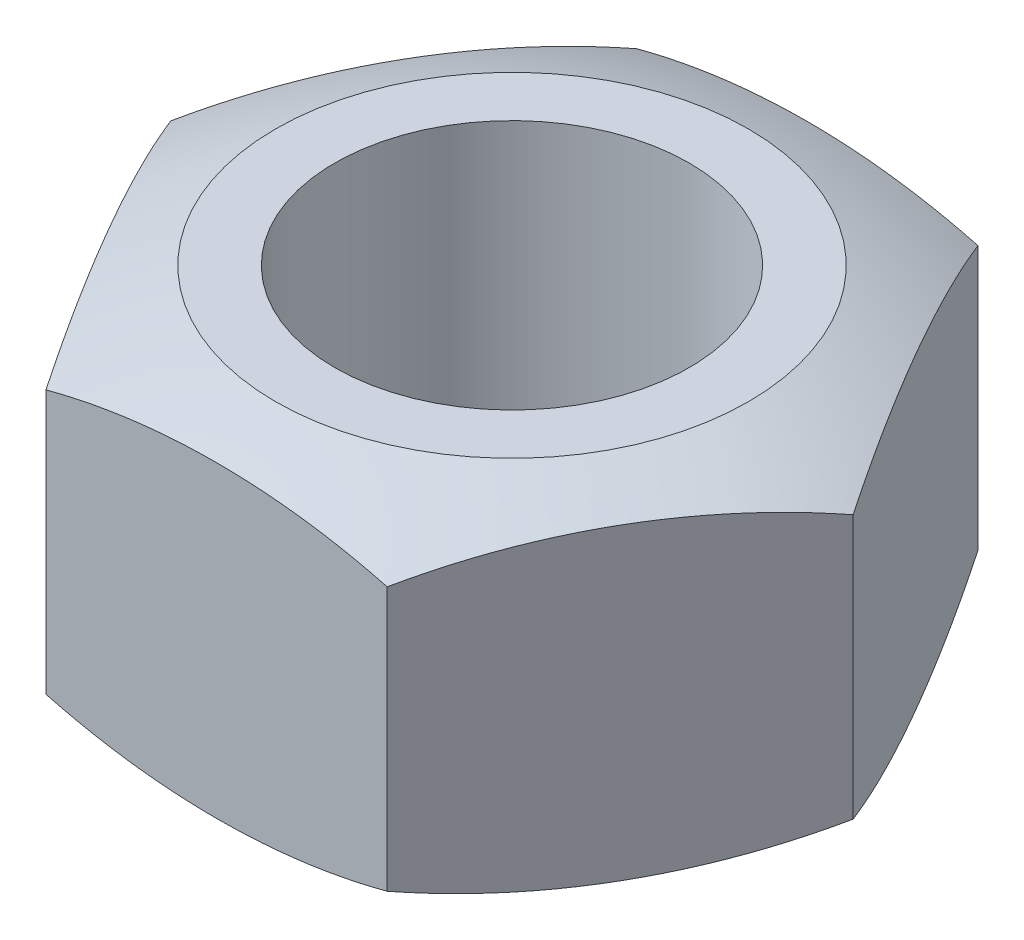
ISO-10303-21;
HEADER;
FILE_DESCRIPTION(('STEP AP214'),'2;1');
FILE_NAME('part.step','',(''),(''),'','','');
FILE_SCHEMA(('AUTOMOTIVE_DESIGN { 1 0 10303 214 1 1 1 1 }'));
ENDSEC;
DATA;
#1=APPLICATION_CONTEXT('core data for automotive mechanical design processes');
#2=APPLICATION_PROTOCOL_DEFINITION('international standard','automotive_design',2000,#1);
#3=PRODUCT_CONTEXT('',#1,'mechanical');
#4=PRODUCT('Part','Part','',(#3));
#5=PRODUCT_RELATED_PRODUCT_CATEGORY('part','',(#4));
#6=PRODUCT_DEFINITION_FORMATION('','',#4);
#7=PRODUCT_DEFINITION_CONTEXT('part definition',#1,'design');
#8=PRODUCT_DEFINITION('design','',#6,#7);
#9=PRODUCT_DEFINITION_SHAPE('','',#8);
#10=(LENGTH_UNIT() NAMED_UNIT(*) SI_UNIT(.MILLI.,.METRE.));
#11=(NAMED_UNIT(*) PLANE_ANGLE_UNIT() SI_UNIT($,.RADIAN.));
#12=(NAMED_UNIT(*) SI_UNIT($,.STERADIAN.) SOLID_ANGLE_UNIT());
#13=UNCERTAINTY_MEASURE_WITH_UNIT(LENGTH_MEASURE(1.E-05),#10,'distance_accuracy_value','');
#14=(GEOMETRIC_REPRESENTATION_CONTEXT(3) GLOBAL_UNCERTAINTY_ASSIGNED_CONTEXT((#13)) GLOBAL_UNIT_ASSIGNED_CONTEXT((#10,
#11,#12)) REPRESENTATION_CONTEXT('',''));
#15=CARTESIAN_POINT('',(0.,0.,0.));
#16=DIRECTION('',(0.,0.,1.));
#17=DIRECTION('',(1.,0.,0.));
#18=AXIS2_PLACEMENT_3D('',#15,#16,#17);
#19=CARTESIAN_POINT('',(2.88675134594813,6.,5.));
#20=DIRECTION('',(0.,-1.,0.));
#21=DIRECTION('',(0.,0.,-1.));
#22=AXIS2_PLACEMENT_3D('',#19,#20,#21);
#23=PLANE('',#22);
#24=CARTESIAN_POINT('',(0.,6.,0.));
#25=DIRECTION('',(0.,-1.,0.));
#26=DIRECTION('',(0.,0.,-1.));
#27=AXIS2_PLACEMENT_3D('',#24,#25,#26);
#28=CIRCLE('',#27,4.);
#29=CARTESIAN_POINT('',(0.,6.,-4.));
#30=VERTEX_POINT('',#29);
#31=EDGE_CURVE('E36',#30,#30,#28,.F.);
#32=ORIENTED_EDGE('',*,*,#31,.T.);
#33=EDGE_LOOP('',(#32));
#34=FACE_BOUND('',#33,.T.);
#35=CARTESIAN_POINT('',(0.,6.,0.));
#36=DIRECTION('',(0.,1.,0.));
#37=DIRECTION('',(0.,0.,1.));
#38=AXIS2_PLACEMENT_3D('',#35,#36,#37);
#39=CIRCLE('',#38,3.);
#40=CARTESIAN_POINT('',(0.,6.,3.));
#41=VERTEX_POINT('',#40);
#42=EDGE_CURVE('E138',#41,#41,#39,.T.);
#43=ORIENTED_EDGE('',*,*,#42,.F.);
#44=EDGE_LOOP('',(#43));
#45=FACE_BOUND('',#44,.T.);
#46=ADVANCED_FACE('F32',(#34,#45),#23,.F.);
#47=CARTESIAN_POINT('',(2.88675134594813,0.,5.));
#48=DIRECTION('',(0.,-1.,0.));
#49=DIRECTION('',(0.,0.,-1.));
#50=AXIS2_PLACEMENT_3D('',#47,#48,#49);
#51=PLANE('',#50);
#52=CARTESIAN_POINT('',(0.,0.,0.));
#53=DIRECTION('',(0.,-1.,0.));
#54=DIRECTION('',(0.,0.,-1.));
#55=AXIS2_PLACEMENT_3D('',#52,#53,#54);
#56=CIRCLE('',#55,4.);
#57=CARTESIAN_POINT('',(0.,0.,-4.));
#58=VERTEX_POINT('',#57);
#59=EDGE_CURVE('E110',#58,#58,#56,.F.);
#60=ORIENTED_EDGE('',*,*,#59,.F.);
#61=EDGE_LOOP('',(#60));
#62=FACE_BOUND('',#61,.T.);
#63=CARTESIAN_POINT('',(0.,0.,0.));
#64=DIRECTION('',(0.,1.,0.));
#65=DIRECTION('',(0.,0.,1.));
#66=AXIS2_PLACEMENT_3D('',#63,#64,#65);
#67=CIRCLE('',#66,3.);
#68=CARTESIAN_POINT('',(0.,0.,3.));
#69=VERTEX_POINT('',#68);
#70=EDGE_CURVE('E141',#69,#69,#67,.T.);
#71=ORIENTED_EDGE('',*,*,#70,.T.);
#72=EDGE_LOOP('',(#71));
#73=FACE_BOUND('',#72,.T.);
#74=ADVANCED_FACE('F168',(#62,#73),#51,.T.);
#75=CARTESIAN_POINT('',(0.,0.,0.));
#76=DIRECTION('',(0.,1.,0.));
#77=DIRECTION('',(0.,0.,1.));
#78=AXIS2_PLACEMENT_3D('',#75,#76,#77);
#79=CYLINDRICAL_SURFACE('',#78,3.);
#80=ORIENTED_EDGE('',*,*,#70,.F.);
#81=EDGE_LOOP('',(#80));
#82=FACE_BOUND('',#81,.T.);
#83=ORIENTED_EDGE('',*,*,#42,.T.);
#84=EDGE_LOOP('',(#83));
#85=FACE_BOUND('',#84,.T.);
#86=ADVANCED_FACE('F173',(#82,#85),#79,.F.);
#87=CARTESIAN_POINT('',(0.,11.6575133769294,0.));
#88=DIRECTION('',(0.,-1.,0.));
#89=DIRECTION('',(1.,0.,0.));
#90=AXIS2_PLACEMENT_3D('',#87,#88,#89);
#91=SPHERICAL_SURFACE('',#90,12.3246751735406);
#92=ORIENTED_EDGE('',*,*,#59,.T.);
#93=EDGE_LOOP('',(#92));
#94=FACE_BOUND('',#93,.T.);
#95=CARTESIAN_POINT('',(0.,11.6575133769294,5.));
#96=DIRECTION('',(0.,0.,-1.));
#97=DIRECTION('',(-1.,0.,0.));
#98=AXIS2_PLACEMENT_3D('',#95,#96,#97);
#99=CIRCLE('',#98,11.2648842929383);
#100=CARTESIAN_POINT('',(-2.88675134594813,0.768790550079844,5.));
#101=VERTEX_POINT('',#100);
#102=CARTESIAN_POINT('',(2.88675134594813,0.768790550079843,5.));
#103=VERTEX_POINT('',#102);
#104=EDGE_CURVE('E112',#101,#103,#99,.F.);
#105=ORIENTED_EDGE('',*,*,#104,.F.);
#106=CARTESIAN_POINT('',(-4.33012701892219,11.6575133769294,2.5));
#107=DIRECTION('',(0.866025403784439,0.,-0.5));
#108=DIRECTION('',(-0.5,0.,-0.866025403784439));
#109=AXIS2_PLACEMENT_3D('',#106,#107,#108);
#110=CIRCLE('',#109,11.2648842929383);
#111=CARTESIAN_POINT('',(-5.77350269189626,0.768790550079844,0.));
#112=VERTEX_POINT('',#111);
#113=EDGE_CURVE('E115',#112,#101,#110,.F.);
#114=ORIENTED_EDGE('',*,*,#113,.F.);
#115=CARTESIAN_POINT('',(-4.33012701892219,11.6575133769294,-2.5));
#116=DIRECTION('',(0.866025403784439,0.,0.5));
#117=DIRECTION('',(0.5,0.,-0.866025403784439));
#118=AXIS2_PLACEMENT_3D('',#115,#116,#117);
#119=CIRCLE('',#118,11.2648842929383);
#120=CARTESIAN_POINT('',(-2.88675134594813,0.768790550079844,-5.));
#121=VERTEX_POINT('',#120);
#122=EDGE_CURVE('E90',#121,#112,#119,.F.);
#123=ORIENTED_EDGE('',*,*,#122,.F.);
#124=CARTESIAN_POINT('',(0.,11.6575133769294,-5.));
#125=DIRECTION('',(0.,0.,1.));
#126=DIRECTION('',(1.,0.,0.));
#127=AXIS2_PLACEMENT_3D('',#124,#125,#126);
#128=CIRCLE('',#127,11.2648842929383);
#129=CARTESIAN_POINT('',(2.88675134594813,0.768790550079844,-5.));
#130=VERTEX_POINT('',#129);
#131=EDGE_CURVE('E85',#130,#121,#128,.F.);
#132=ORIENTED_EDGE('',*,*,#131,.F.);
#133=CARTESIAN_POINT('',(4.33012701892219,11.6575133769294,-2.5));
#134=DIRECTION('',(-0.866025403784438,0.,0.5));
#135=DIRECTION('',(0.5,0.,0.866025403784438));
#136=AXIS2_PLACEMENT_3D('',#133,#134,#135);
#137=CIRCLE('',#136,11.2648842929383);
#138=CARTESIAN_POINT('',(5.77350269189626,0.768790550079844,0.));
#139=VERTEX_POINT('',#138);
#140=EDGE_CURVE('E88',#139,#130,#137,.F.);
#141=ORIENTED_EDGE('',*,*,#140,.F.);
#142=CARTESIAN_POINT('',(4.3301270189222,11.6575133769294,2.5));
#143=DIRECTION('',(-0.866025403784439,0.,-0.5));
#144=DIRECTION('',(-0.5,0.,0.866025403784439));
#145=AXIS2_PLACEMENT_3D('',#142,#143,#144);
#146=CIRCLE('',#145,11.2648842929383);
#147=EDGE_CURVE('E57',#103,#139,#146,.F.);
#148=ORIENTED_EDGE('',*,*,#147,.F.);
#149=EDGE_LOOP('',(#105,#114,#123,#132,#141,#148));
#150=FACE_BOUND('',#149,.T.);
#151=ADVANCED_FACE('F87',(#94,#150),#91,.T.);
#152=CARTESIAN_POINT('',(0.,-5.6575133769294,0.));
#153=DIRECTION('',(0.,-1.,0.));
#154=DIRECTION('',(1.,0.,0.));
#155=AXIS2_PLACEMENT_3D('',#152,#153,#154);
#156=SPHERICAL_SURFACE('',#155,12.3246751735406);
#157=ORIENTED_EDGE('',*,*,#31,.F.);
#158=EDGE_LOOP('',(#157));
#159=FACE_BOUND('',#158,.T.);
#160=CARTESIAN_POINT('',(4.33012701892219,-5.6575133769294,-2.5));
#161=DIRECTION('',(-0.866025403784438,0.,0.5));
#162=DIRECTION('',(0.5,0.,0.866025403784438));
#163=AXIS2_PLACEMENT_3D('',#160,#161,#162);
#164=CIRCLE('',#163,11.2648842929383);
#165=CARTESIAN_POINT('',(2.88675134594812,5.23120944992016,-5.));
#166=VERTEX_POINT('',#165);
#167=CARTESIAN_POINT('',(5.77350269189626,5.23120944992016,0.));
#168=VERTEX_POINT('',#167);
#169=EDGE_CURVE('E133',#166,#168,#164,.F.);
#170=ORIENTED_EDGE('',*,*,#169,.F.);
#171=CARTESIAN_POINT('',(0.,-5.6575133769294,-5.));
#172=DIRECTION('',(0.,0.,1.));
#173=DIRECTION('',(1.,0.,0.));
#174=AXIS2_PLACEMENT_3D('',#171,#172,#173);
#175=CIRCLE('',#174,11.2648842929383);
#176=CARTESIAN_POINT('',(-2.88675134594813,5.23120944992016,-5.));
#177=VERTEX_POINT('',#176);
#178=EDGE_CURVE('E104',#177,#166,#175,.F.);
#179=ORIENTED_EDGE('',*,*,#178,.F.);
#180=CARTESIAN_POINT('',(-4.33012701892219,-5.6575133769294,-2.5));
#181=DIRECTION('',(0.866025403784439,0.,0.5));
#182=DIRECTION('',(0.5,0.,-0.866025403784439));
#183=AXIS2_PLACEMENT_3D('',#180,#181,#182);
#184=CIRCLE('',#183,11.2648842929383);
#185=CARTESIAN_POINT('',(-5.77350269189626,5.23120944992016,0.));
#186=VERTEX_POINT('',#185);
#187=EDGE_CURVE('E129',#186,#177,#184,.F.);
#188=ORIENTED_EDGE('',*,*,#187,.F.);
#189=CARTESIAN_POINT('',(-4.33012701892219,-5.6575133769294,2.5));
#190=DIRECTION('',(0.866025403784439,0.,-0.5));
#191=DIRECTION('',(-0.5,0.,-0.866025403784439));
#192=AXIS2_PLACEMENT_3D('',#189,#190,#191);
#193=CIRCLE('',#192,11.2648842929383);
#194=CARTESIAN_POINT('',(-2.88675134594813,5.23120944992016,5.));
#195=VERTEX_POINT('',#194);
#196=EDGE_CURVE('E49',#195,#186,#193,.F.);
#197=ORIENTED_EDGE('',*,*,#196,.F.);
#198=CARTESIAN_POINT('',(0.,-5.6575133769294,5.));
#199=DIRECTION('',(0.,0.,-1.));
#200=DIRECTION('',(-1.,0.,0.));
#201=AXIS2_PLACEMENT_3D('',#198,#199,#200);
#202=CIRCLE('',#201,11.2648842929383);
#203=CARTESIAN_POINT('',(2.88675134594813,5.23120944992016,5.));
#204=VERTEX_POINT('',#203);
#205=EDGE_CURVE('E126',#204,#195,#202,.F.);
#206=ORIENTED_EDGE('',*,*,#205,.F.);
#207=CARTESIAN_POINT('',(4.3301270189222,-5.6575133769294,2.5));
#208=DIRECTION('',(-0.866025403784439,0.,-0.5));
#209=DIRECTION('',(-0.5,0.,0.866025403784439));
#210=AXIS2_PLACEMENT_3D('',#207,#208,#209);
#211=CIRCLE('',#210,11.2648842929383);
#212=EDGE_CURVE('E135',#168,#204,#211,.F.);
#213=ORIENTED_EDGE('',*,*,#212,.F.);
#214=EDGE_LOOP('',(#170,#179,#188,#197,#206,#213));
#215=FACE_BOUND('',#214,.T.);
#216=ADVANCED_FACE('F154',(#159,#215),#156,.T.);
#217=CARTESIAN_POINT('',(-2.88675134594813,6.,5.));
#218=DIRECTION('',(0.,0.,-1.));
#219=DIRECTION('',(-1.,0.,0.));
#220=AXIS2_PLACEMENT_3D('',#217,#218,#219);
#221=PLANE('',#220);
#222=DIRECTION('',(0.,-1.,0.));
#223=VECTOR('',#222,1.);
#224=CARTESIAN_POINT('',(2.88675134594813,6.,5.));
#225=LINE('',#224,#223);
#226=EDGE_CURVE('E144',#204,#103,#225,.T.);
#227=ORIENTED_EDGE('',*,*,#226,.F.);
#228=ORIENTED_EDGE('',*,*,#205,.T.);
#229=DIRECTION('',(0.,-1.,0.));
#230=VECTOR('',#229,1.);
#231=CARTESIAN_POINT('',(-2.88675134594813,6.,5.));
#232=LINE('',#231,#230);
#233=EDGE_CURVE('E146',#195,#101,#232,.T.);
#234=ORIENTED_EDGE('',*,*,#233,.T.);
#235=ORIENTED_EDGE('',*,*,#104,.T.);
#236=EDGE_LOOP('',(#227,#228,#234,#235));
#237=FACE_BOUND('',#236,.T.);
#238=ADVANCED_FACE('F156',(#237),#221,.F.);
#239=CARTESIAN_POINT('',(-5.77350269189626,6.,0.));
#240=DIRECTION('',(0.866025403784439,0.,-0.5));
#241=DIRECTION('',(-0.5,0.,-0.866025403784439));
#242=AXIS2_PLACEMENT_3D('',#239,#240,#241);
#243=PLANE('',#242);
#244=ORIENTED_EDGE('',*,*,#233,.F.);
#245=ORIENTED_EDGE('',*,*,#196,.T.);
#246=DIRECTION('',(0.,-1.,0.));
#247=VECTOR('',#246,1.);
#248=CARTESIAN_POINT('',(-5.77350269189626,6.,0.));
#249=LINE('',#248,#247);
#250=EDGE_CURVE('E107',#186,#112,#249,.T.);
#251=ORIENTED_EDGE('',*,*,#250,.T.);
#252=ORIENTED_EDGE('',*,*,#113,.T.);
#253=EDGE_LOOP('',(#244,#245,#251,#252));
#254=FACE_BOUND('',#253,.T.);
#255=ADVANCED_FACE('F151',(#254),#243,.F.);
#256=CARTESIAN_POINT('',(-2.88675134594813,6.,-5.));
#257=DIRECTION('',(0.866025403784439,0.,0.5));
#258=DIRECTION('',(0.5,0.,-0.866025403784439));
#259=AXIS2_PLACEMENT_3D('',#256,#257,#258);
#260=PLANE('',#259);
#261=ORIENTED_EDGE('',*,*,#250,.F.);
#262=ORIENTED_EDGE('',*,*,#187,.T.);
#263=DIRECTION('',(0.,-1.,0.));
#264=VECTOR('',#263,1.);
#265=CARTESIAN_POINT('',(-2.88675134594813,6.,-5.));
#266=LINE('',#265,#264);
#267=EDGE_CURVE('E105',#177,#121,#266,.T.);
#268=ORIENTED_EDGE('',*,*,#267,.T.);
#269=ORIENTED_EDGE('',*,*,#122,.T.);
#270=EDGE_LOOP('',(#261,#262,#268,#269));
#271=FACE_BOUND('',#270,.T.);
#272=ADVANCED_FACE('F153',(#271),#260,.F.);
#273=CARTESIAN_POINT('',(2.88675134594813,6.,-5.));
#274=DIRECTION('',(0.,0.,1.));
#275=DIRECTION('',(1.,0.,0.));
#276=AXIS2_PLACEMENT_3D('',#273,#274,#275);
#277=PLANE('',#276);
#278=ORIENTED_EDGE('',*,*,#267,.F.);
#279=ORIENTED_EDGE('',*,*,#178,.T.);
#280=DIRECTION('',(0.,-1.,0.));
#281=VECTOR('',#280,1.);
#282=CARTESIAN_POINT('',(2.88675134594813,6.,-5.));
#283=LINE('',#282,#281);
#284=EDGE_CURVE('E41',#166,#130,#283,.T.);
#285=ORIENTED_EDGE('',*,*,#284,.T.);
#286=ORIENTED_EDGE('',*,*,#131,.T.);
#287=EDGE_LOOP('',(#278,#279,#285,#286));
#288=FACE_BOUND('',#287,.T.);
#289=ADVANCED_FACE('F103',(#288),#277,.F.);
#290=CARTESIAN_POINT('',(5.77350269189626,6.,0.));
#291=DIRECTION('',(-0.866025403784438,0.,0.5));
#292=DIRECTION('',(0.5,0.,0.866025403784438));
#293=AXIS2_PLACEMENT_3D('',#290,#291,#292);
#294=PLANE('',#293);
#295=ORIENTED_EDGE('',*,*,#284,.F.);
#296=ORIENTED_EDGE('',*,*,#169,.T.);
#297=DIRECTION('',(0.,-1.,0.));
#298=VECTOR('',#297,1.);
#299=CARTESIAN_POINT('',(5.77350269189626,6.,0.));
#300=LINE('',#299,#298);
#301=EDGE_CURVE('E11',#168,#139,#300,.T.);
#302=ORIENTED_EDGE('',*,*,#301,.T.);
#303=ORIENTED_EDGE('',*,*,#140,.T.);
#304=EDGE_LOOP('',(#295,#296,#302,#303));
#305=FACE_BOUND('',#304,.T.);
#306=ADVANCED_FACE('F98',(#305),#294,.F.);
#307=CARTESIAN_POINT('',(2.88675134594813,6.,5.));
#308=DIRECTION('',(-0.866025403784439,0.,-0.5));
#309=DIRECTION('',(-0.5,0.,0.866025403784439));
#310=AXIS2_PLACEMENT_3D('',#307,#308,#309);
#311=PLANE('',#310);
#312=ORIENTED_EDGE('',*,*,#301,.F.);
#313=ORIENTED_EDGE('',*,*,#212,.T.);
#314=ORIENTED_EDGE('',*,*,#226,.T.);
#315=ORIENTED_EDGE('',*,*,#147,.T.);
#316=EDGE_LOOP('',(#312,#313,#314,#315));
#317=FACE_BOUND('',#316,.T.);
#318=ADVANCED_FACE('F34',(#317),#311,.F.);
#319=CLOSED_SHELL('',(#46,#74,#86,#151,#216,#238,#255,#272,#289,#306,#318));
#320=MANIFOLD_SOLID_BREP('B2',#319);
#321=ADVANCED_BREP_SHAPE_REPRESENTATION('',(#18,#320),#14);
#322=SHAPE_DEFINITION_REPRESENTATION(#9,#321);
ENDSEC;
END-ISO-10303-21;
